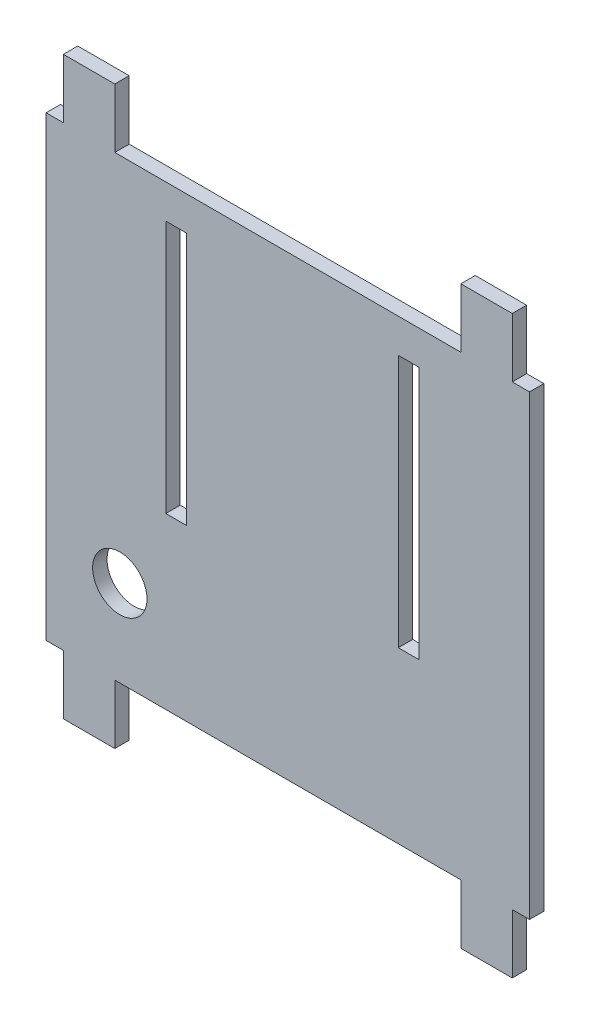
ISO-10303-21;
HEADER;
FILE_DESCRIPTION(('STEP AP214'),'2;1');
FILE_NAME('part.step','',(''),(''),'','','');
FILE_SCHEMA(('AUTOMOTIVE_DESIGN { 1 0 10303 214 1 1 1 1 }'));
ENDSEC;
DATA;
#1=APPLICATION_CONTEXT('core data for automotive mechanical design processes');
#2=APPLICATION_PROTOCOL_DEFINITION('international standard','automotive_design',2000,#1);
#3=PRODUCT_CONTEXT('',#1,'mechanical');
#4=PRODUCT('Part','Part','',(#3));
#5=PRODUCT_RELATED_PRODUCT_CATEGORY('part','',(#4));
#6=PRODUCT_DEFINITION_FORMATION('','',#4);
#7=PRODUCT_DEFINITION_CONTEXT('part definition',#1,'design');
#8=PRODUCT_DEFINITION('design','',#6,#7);
#9=PRODUCT_DEFINITION_SHAPE('','',#8);
#10=(LENGTH_UNIT() NAMED_UNIT(*) SI_UNIT(.MILLI.,.METRE.));
#11=(NAMED_UNIT(*) PLANE_ANGLE_UNIT() SI_UNIT($,.RADIAN.));
#12=(NAMED_UNIT(*) SI_UNIT($,.STERADIAN.) SOLID_ANGLE_UNIT());
#13=UNCERTAINTY_MEASURE_WITH_UNIT(LENGTH_MEASURE(1.E-05),#10,'distance_accuracy_value','');
#14=(GEOMETRIC_REPRESENTATION_CONTEXT(3) GLOBAL_UNCERTAINTY_ASSIGNED_CONTEXT((#13)) GLOBAL_UNIT_ASSIGNED_CONTEXT((#10,
#11,#12)) REPRESENTATION_CONTEXT('',''));
#15=CARTESIAN_POINT('',(0.,0.,0.));
#16=DIRECTION('',(0.,0.,1.));
#17=DIRECTION('',(1.,0.,0.));
#18=AXIS2_PLACEMENT_3D('',#15,#16,#17);
#19=CARTESIAN_POINT('',(-38.1782839349794,-47.5128276843631,3.175));
#20=DIRECTION('',(0.,1.,0.));
#21=DIRECTION('',(0.,0.,1.));
#22=AXIS2_PLACEMENT_3D('',#19,#20,#21);
#23=PLANE('',#22);
#24=DIRECTION('',(1.,0.,0.));
#25=VECTOR('',#24,1.);
#26=CARTESIAN_POINT('',(-38.1782839349794,-47.5128276843631,3.175));
#27=LINE('',#26,#25);
#28=CARTESIAN_POINT('',(-34.3682839349794,-47.5128276843631,3.175));
#29=VERTEX_POINT('',#28);
#30=CARTESIAN_POINT('',(-23.0182939349794,-47.5128276843631,3.175));
#31=VERTEX_POINT('',#30);
#32=EDGE_CURVE('E428',#29,#31,#27,.T.);
#33=ORIENTED_EDGE('',*,*,#32,.F.);
#34=DIRECTION('',(0.,0.,1.));
#35=VECTOR('',#34,1.);
#36=CARTESIAN_POINT('',(-34.3682839349794,-47.5128276843631,0.));
#37=LINE('',#36,#35);
#38=CARTESIAN_POINT('',(-34.3682839349794,-47.5128276843631,0.));
#39=VERTEX_POINT('',#38);
#40=EDGE_CURVE('E284',#39,#29,#37,.T.);
#41=ORIENTED_EDGE('',*,*,#40,.F.);
#42=DIRECTION('',(1.,0.,0.));
#43=VECTOR('',#42,1.);
#44=CARTESIAN_POINT('',(-38.1782839349794,-47.5128276843631,0.));
#45=LINE('',#44,#43);
#46=CARTESIAN_POINT('',(-23.0182939349794,-47.5128276843631,0.));
#47=VERTEX_POINT('',#46);
#48=EDGE_CURVE('E436',#39,#47,#45,.T.);
#49=ORIENTED_EDGE('',*,*,#48,.T.);
#50=DIRECTION('',(0.,0.,1.));
#51=VECTOR('',#50,1.);
#52=CARTESIAN_POINT('',(-23.0182939349794,-47.5128276843631,0.));
#53=LINE('',#52,#51);
#54=EDGE_CURVE('E305',#47,#31,#53,.T.);
#55=ORIENTED_EDGE('',*,*,#54,.T.);
#56=EDGE_LOOP('',(#33,#41,#49,#55));
#57=FACE_BOUND('',#56,.T.);
#58=ADVANCED_FACE('F34',(#57),#23,.F.);
#59=CARTESIAN_POINT('',(-38.1782839349794,79.4871723156369,3.175));
#60=DIRECTION('',(0.,-1.,0.));
#61=DIRECTION('',(0.,0.,-1.));
#62=AXIS2_PLACEMENT_3D('',#59,#60,#61);
#63=PLANE('',#62);
#64=DIRECTION('',(-1.,0.,0.));
#65=VECTOR('',#64,1.);
#66=CARTESIAN_POINT('',(-38.1782839349794,79.4871723156369,3.175));
#67=LINE('',#66,#65);
#68=CARTESIAN_POINT('',(-23.0182939349794,79.4871723156369,3.175));
#69=VERTEX_POINT('',#68);
#70=CARTESIAN_POINT('',(-34.3682839349794,79.4871723156369,3.175));
#71=VERTEX_POINT('',#70);
#72=EDGE_CURVE('E43',#69,#71,#67,.T.);
#73=ORIENTED_EDGE('',*,*,#72,.F.);
#74=DIRECTION('',(0.,0.,1.));
#75=VECTOR('',#74,1.);
#76=CARTESIAN_POINT('',(-23.0182939349794,79.4871723156369,0.));
#77=LINE('',#76,#75);
#78=CARTESIAN_POINT('',(-23.0182939349794,79.4871723156369,0.));
#79=VERTEX_POINT('',#78);
#80=EDGE_CURVE('E254',#79,#69,#77,.T.);
#81=ORIENTED_EDGE('',*,*,#80,.F.);
#82=DIRECTION('',(-1.,0.,0.));
#83=VECTOR('',#82,1.);
#84=CARTESIAN_POINT('',(-38.1782839349794,79.4871723156369,0.));
#85=LINE('',#84,#83);
#86=CARTESIAN_POINT('',(-34.3682839349794,79.4871723156369,0.));
#87=VERTEX_POINT('',#86);
#88=EDGE_CURVE('E38',#79,#87,#85,.T.);
#89=ORIENTED_EDGE('',*,*,#88,.T.);
#90=DIRECTION('',(0.,0.,1.));
#91=VECTOR('',#90,1.);
#92=CARTESIAN_POINT('',(-34.3682839349794,79.4871723156369,0.));
#93=LINE('',#92,#91);
#94=EDGE_CURVE('E350',#87,#71,#93,.T.);
#95=ORIENTED_EDGE('',*,*,#94,.T.);
#96=EDGE_LOOP('',(#73,#81,#89,#95));
#97=FACE_BOUND('',#96,.T.);
#98=ADVANCED_FACE('F478',(#97),#63,.F.);
#99=CARTESIAN_POINT('',(-38.1782839349794,79.4871723156369,3.175));
#100=DIRECTION('',(1.,0.,0.));
#101=DIRECTION('',(0.,1.,0.));
#102=AXIS2_PLACEMENT_3D('',#99,#100,#101);
#103=PLANE('',#102);
#104=DIRECTION('',(0.,-1.,0.));
#105=VECTOR('',#104,1.);
#106=CARTESIAN_POINT('',(-38.1782839349794,79.4871723156369,0.));
#107=LINE('',#106,#105);
#108=CARTESIAN_POINT('',(-38.1782839349794,66.4071629156369,0.));
#109=VERTEX_POINT('',#108);
#110=CARTESIAN_POINT('',(-38.1782839349794,-34.4328182843631,0.));
#111=VERTEX_POINT('',#110);
#112=EDGE_CURVE('E414',#109,#111,#107,.T.);
#113=ORIENTED_EDGE('',*,*,#112,.T.);
#114=DIRECTION('',(0.,0.,1.));
#115=VECTOR('',#114,1.);
#116=CARTESIAN_POINT('',(-38.1782839349794,-34.4328182843631,0.));
#117=LINE('',#116,#115);
#118=CARTESIAN_POINT('',(-38.1782839349794,-34.4328182843631,3.175));
#119=VERTEX_POINT('',#118);
#120=EDGE_CURVE('E270',#111,#119,#117,.T.);
#121=ORIENTED_EDGE('',*,*,#120,.T.);
#122=DIRECTION('',(0.,-1.,0.));
#123=VECTOR('',#122,1.);
#124=CARTESIAN_POINT('',(-38.1782839349794,79.4871723156369,3.175));
#125=LINE('',#124,#123);
#126=CARTESIAN_POINT('',(-38.1782839349794,66.4071629156369,3.175));
#127=VERTEX_POINT('',#126);
#128=EDGE_CURVE('E421',#127,#119,#125,.T.);
#129=ORIENTED_EDGE('',*,*,#128,.F.);
#130=DIRECTION('',(0.,0.,1.));
#131=VECTOR('',#130,1.);
#132=CARTESIAN_POINT('',(-38.1782839349794,66.4071629156369,0.));
#133=LINE('',#132,#131);
#134=EDGE_CURVE('E345',#109,#127,#133,.T.);
#135=ORIENTED_EDGE('',*,*,#134,.F.);
#136=EDGE_LOOP('',(#113,#121,#129,#135));
#137=FACE_BOUND('',#136,.T.);
#138=ADVANCED_FACE('F36',(#137),#103,.F.);
#139=CARTESIAN_POINT('',(53.3417260650209,-47.5128276843631,3.175));
#140=VERTEX_POINT('',#139);
#141=CARTESIAN_POINT('',(64.6917160650209,-47.5128276843631,3.175));
#142=VERTEX_POINT('',#141);
#143=EDGE_CURVE('E424',#140,#142,#27,.T.);
#144=ORIENTED_EDGE('',*,*,#143,.F.);
#145=DIRECTION('',(0.,0.,1.));
#146=VECTOR('',#145,1.);
#147=CARTESIAN_POINT('',(53.3417260650209,-47.5128276843631,0.));
#148=LINE('',#147,#146);
#149=CARTESIAN_POINT('',(53.3417260650209,-47.5128276843631,0.));
#150=VERTEX_POINT('',#149);
#151=EDGE_CURVE('E317',#150,#140,#148,.T.);
#152=ORIENTED_EDGE('',*,*,#151,.F.);
#153=CARTESIAN_POINT('',(64.6917160650209,-47.5128276843631,0.));
#154=VERTEX_POINT('',#153);
#155=EDGE_CURVE('E434',#150,#154,#45,.T.);
#156=ORIENTED_EDGE('',*,*,#155,.T.);
#157=DIRECTION('',(0.,0.,1.));
#158=VECTOR('',#157,1.);
#159=CARTESIAN_POINT('',(64.6917160650209,-47.5128276843631,0.));
#160=LINE('',#159,#158);
#161=EDGE_CURVE('E309',#154,#142,#160,.T.);
#162=ORIENTED_EDGE('',*,*,#161,.T.);
#163=EDGE_LOOP('',(#144,#152,#156,#162));
#164=FACE_BOUND('',#163,.T.);
#165=ADVANCED_FACE('F504',(#164),#23,.F.);
#166=CARTESIAN_POINT('',(68.5017160650206,79.4871723156369,3.175));
#167=DIRECTION('',(-1.,0.,0.));
#168=DIRECTION('',(0.,-1.,0.));
#169=AXIS2_PLACEMENT_3D('',#166,#167,#168);
#170=PLANE('',#169);
#171=DIRECTION('',(0.,1.,0.));
#172=VECTOR('',#171,1.);
#173=CARTESIAN_POINT('',(68.5017160650206,79.4871723156369,0.));
#174=LINE('',#173,#172);
#175=CARTESIAN_POINT('',(68.5017160650206,-34.4328182843631,0.));
#176=VERTEX_POINT('',#175);
#177=CARTESIAN_POINT('',(68.5017160650206,66.4071629156369,0.));
#178=VERTEX_POINT('',#177);
#179=EDGE_CURVE('E437',#176,#178,#174,.T.);
#180=ORIENTED_EDGE('',*,*,#179,.T.);
#181=DIRECTION('',(0.,0.,1.));
#182=VECTOR('',#181,1.);
#183=CARTESIAN_POINT('',(68.5017160650206,66.4071629156369,0.));
#184=LINE('',#183,#182);
#185=CARTESIAN_POINT('',(68.5017160650206,66.4071629156369,3.175));
#186=VERTEX_POINT('',#185);
#187=EDGE_CURVE('E252',#178,#186,#184,.T.);
#188=ORIENTED_EDGE('',*,*,#187,.T.);
#189=DIRECTION('',(0.,1.,0.));
#190=VECTOR('',#189,1.);
#191=CARTESIAN_POINT('',(68.5017160650206,79.4871723156369,3.175));
#192=LINE('',#191,#190);
#193=CARTESIAN_POINT('',(68.5017160650206,-34.4328182843631,3.175));
#194=VERTEX_POINT('',#193);
#195=EDGE_CURVE('E429',#194,#186,#192,.T.);
#196=ORIENTED_EDGE('',*,*,#195,.F.);
#197=DIRECTION('',(0.,0.,1.));
#198=VECTOR('',#197,1.);
#199=CARTESIAN_POINT('',(68.5017160650206,-34.4328182843631,0.));
#200=LINE('',#199,#198);
#201=EDGE_CURVE('E328',#176,#194,#200,.T.);
#202=ORIENTED_EDGE('',*,*,#201,.F.);
#203=EDGE_LOOP('',(#180,#188,#196,#202));
#204=FACE_BOUND('',#203,.T.);
#205=ADVANCED_FACE('F493',(#204),#170,.F.);
#206=CARTESIAN_POINT('',(64.6917160650206,79.4871723156369,0.));
#207=VERTEX_POINT('',#206);
#208=CARTESIAN_POINT('',(53.3417260650206,79.4871723156369,0.));
#209=VERTEX_POINT('',#208);
#210=EDGE_CURVE('E425',#207,#209,#85,.T.);
#211=ORIENTED_EDGE('',*,*,#210,.T.);
#212=DIRECTION('',(0.,0.,1.));
#213=VECTOR('',#212,1.);
#214=CARTESIAN_POINT('',(53.3417260650206,79.4871723156369,0.));
#215=LINE('',#214,#213);
#216=CARTESIAN_POINT('',(53.3417260650206,79.4871723156369,3.175));
#217=VERTEX_POINT('',#216);
#218=EDGE_CURVE('E257',#209,#217,#215,.T.);
#219=ORIENTED_EDGE('',*,*,#218,.T.);
#220=CARTESIAN_POINT('',(64.6917160650206,79.4871723156369,3.175));
#221=VERTEX_POINT('',#220);
#222=EDGE_CURVE('E12',#221,#217,#67,.T.);
#223=ORIENTED_EDGE('',*,*,#222,.F.);
#224=DIRECTION('',(0.,0.,1.));
#225=VECTOR('',#224,1.);
#226=CARTESIAN_POINT('',(64.6917160650206,79.4871723156369,0.));
#227=LINE('',#226,#225);
#228=EDGE_CURVE('E266',#207,#221,#227,.T.);
#229=ORIENTED_EDGE('',*,*,#228,.F.);
#230=EDGE_LOOP('',(#211,#219,#223,#229));
#231=FACE_BOUND('',#230,.T.);
#232=ADVANCED_FACE('F485',(#231),#63,.F.);
#233=CARTESIAN_POINT('',(0.,0.,3.175));
#234=DIRECTION('',(0.,0.,1.));
#235=DIRECTION('',(1.,0.,0.));
#236=AXIS2_PLACEMENT_3D('',#233,#234,#235);
#237=PLANE('',#236);
#238=CARTESIAN_POINT('',(-21.9095839349794,-15.3828182843631,3.175));
#239=DIRECTION('',(0.,0.,1.));
#240=DIRECTION('',(1.,0.,0.));
#241=AXIS2_PLACEMENT_3D('',#238,#239,#240);
#242=CIRCLE('',#241,5.999999938);
#243=CARTESIAN_POINT('',(-15.9095839969794,-15.3828182843631,3.175));
#244=VERTEX_POINT('',#243);
#245=EDGE_CURVE('E247',#244,#244,#242,.T.);
#246=ORIENTED_EDGE('',*,*,#245,.F.);
#247=EDGE_LOOP('',(#246));
#248=FACE_BOUND('',#247,.T.);
#249=DIRECTION('',(0.,-1.,0.));
#250=VECTOR('',#249,1.);
#251=CARTESIAN_POINT('',(-23.0182939349794,79.4871723156369,3.175));
#252=LINE('',#251,#250);
#253=CARTESIAN_POINT('',(-23.0182939349794,66.4071629156369,3.175));
#254=VERTEX_POINT('',#253);
#255=EDGE_CURVE('E227',#69,#254,#252,.T.);
#256=ORIENTED_EDGE('',*,*,#255,.F.);
#257=ORIENTED_EDGE('',*,*,#72,.T.);
#258=DIRECTION('',(0.,1.,0.));
#259=VECTOR('',#258,1.);
#260=CARTESIAN_POINT('',(-34.3682839349794,79.4871723156369,3.175));
#261=LINE('',#260,#259);
#262=CARTESIAN_POINT('',(-34.3682839349794,66.4071629156369,3.175));
#263=VERTEX_POINT('',#262);
#264=EDGE_CURVE('E343',#263,#71,#261,.T.);
#265=ORIENTED_EDGE('',*,*,#264,.F.);
#266=DIRECTION('',(1.,0.,0.));
#267=VECTOR('',#266,1.);
#268=CARTESIAN_POINT('',(-38.1782839349794,66.4071629156369,3.175));
#269=LINE('',#268,#267);
#270=EDGE_CURVE('E256',#127,#263,#269,.T.);
#271=ORIENTED_EDGE('',*,*,#270,.F.);
#272=ORIENTED_EDGE('',*,*,#128,.T.);
#273=DIRECTION('',(-1.,0.,0.));
#274=VECTOR('',#273,1.);
#275=CARTESIAN_POINT('',(-38.1782839349794,-34.4328182843631,3.175));
#276=LINE('',#275,#274);
#277=CARTESIAN_POINT('',(-34.3682839349794,-34.4328182843631,3.175));
#278=VERTEX_POINT('',#277);
#279=EDGE_CURVE('E281',#278,#119,#276,.T.);
#280=ORIENTED_EDGE('',*,*,#279,.F.);
#281=DIRECTION('',(0.,1.,0.));
#282=VECTOR('',#281,1.);
#283=CARTESIAN_POINT('',(-34.3682839349794,-34.4328182843631,3.175));
#284=LINE('',#283,#282);
#285=EDGE_CURVE('E285',#29,#278,#284,.T.);
#286=ORIENTED_EDGE('',*,*,#285,.F.);
#287=ORIENTED_EDGE('',*,*,#32,.T.);
#288=DIRECTION('',(0.,-1.,0.));
#289=VECTOR('',#288,1.);
#290=CARTESIAN_POINT('',(-23.0182939349794,-34.4328182843631,3.175));
#291=LINE('',#290,#289);
#292=CARTESIAN_POINT('',(-23.0182939349794,-34.4328182843631,3.175));
#293=VERTEX_POINT('',#292);
#294=EDGE_CURVE('E306',#293,#31,#291,.T.);
#295=ORIENTED_EDGE('',*,*,#294,.F.);
#296=DIRECTION('',(-1.,0.,0.));
#297=VECTOR('',#296,1.);
#298=CARTESIAN_POINT('',(-23.0182939349794,-34.4328182843631,3.175));
#299=LINE('',#298,#297);
#300=CARTESIAN_POINT('',(53.3417260650209,-34.4328182843631,3.175));
#301=VERTEX_POINT('',#300);
#302=EDGE_CURVE('E299',#301,#293,#299,.T.);
#303=ORIENTED_EDGE('',*,*,#302,.F.);
#304=DIRECTION('',(0.,1.,0.));
#305=VECTOR('',#304,1.);
#306=CARTESIAN_POINT('',(53.3417260650209,-34.4328182843631,3.175));
#307=LINE('',#306,#305);
#308=EDGE_CURVE('E308',#140,#301,#307,.T.);
#309=ORIENTED_EDGE('',*,*,#308,.F.);
#310=ORIENTED_EDGE('',*,*,#143,.T.);
#311=DIRECTION('',(0.,-1.,0.));
#312=VECTOR('',#311,1.);
#313=CARTESIAN_POINT('',(64.6917160650209,-34.4328182843631,3.175));
#314=LINE('',#313,#312);
#315=CARTESIAN_POINT('',(64.6917160650209,-34.4328182843631,3.175));
#316=VERTEX_POINT('',#315);
#317=EDGE_CURVE('E325',#316,#142,#314,.T.);
#318=ORIENTED_EDGE('',*,*,#317,.F.);
#319=DIRECTION('',(-1.,0.,0.));
#320=VECTOR('',#319,1.);
#321=CARTESIAN_POINT('',(68.5017160650206,-34.4328182843631,3.175));
#322=LINE('',#321,#320);
#323=EDGE_CURVE('E329',#194,#316,#322,.T.);
#324=ORIENTED_EDGE('',*,*,#323,.F.);
#325=ORIENTED_EDGE('',*,*,#195,.T.);
#326=DIRECTION('',(1.,0.,0.));
#327=VECTOR('',#326,1.);
#328=CARTESIAN_POINT('',(68.5017160650206,66.4071629156369,3.175));
#329=LINE('',#328,#327);
#330=CARTESIAN_POINT('',(64.6917160650206,66.4071629156369,3.175));
#331=VERTEX_POINT('',#330);
#332=EDGE_CURVE('E264',#331,#186,#329,.T.);
#333=ORIENTED_EDGE('',*,*,#332,.F.);
#334=DIRECTION('',(0.,-1.,0.));
#335=VECTOR('',#334,1.);
#336=CARTESIAN_POINT('',(64.6917160650206,79.4871723156369,3.175));
#337=LINE('',#336,#335);
#338=EDGE_CURVE('E267',#221,#331,#337,.T.);
#339=ORIENTED_EDGE('',*,*,#338,.F.);
#340=ORIENTED_EDGE('',*,*,#222,.T.);
#341=DIRECTION('',(0.,1.,0.));
#342=VECTOR('',#341,1.);
#343=CARTESIAN_POINT('',(53.3417260650206,79.4871723156369,3.175));
#344=LINE('',#343,#342);
#345=CARTESIAN_POINT('',(53.3417260650206,66.4071629156369,3.175));
#346=VERTEX_POINT('',#345);
#347=EDGE_CURVE('E242',#346,#217,#344,.T.);
#348=ORIENTED_EDGE('',*,*,#347,.F.);
#349=DIRECTION('',(1.,0.,0.));
#350=VECTOR('',#349,1.);
#351=CARTESIAN_POINT('',(-23.0182939349794,66.4071629156369,3.175));
#352=LINE('',#351,#350);
#353=EDGE_CURVE('E244',#254,#346,#352,.T.);
#354=ORIENTED_EDGE('',*,*,#353,.F.);
#355=EDGE_LOOP('',(#256,#257,#265,#271,#272,#280,#286,#287,#295,#303,#309,#310,#318,#324,#325,
#333,#339,#340,#348,#354));
#356=FACE_BOUND('',#355,.T.);
#357=DIRECTION('',(0.,-1.,0.));
#358=VECTOR('',#357,1.);
#359=CARTESIAN_POINT('',(39.5457160650206,58.9131723156369,3.175));
#360=LINE('',#359,#358);
#361=CARTESIAN_POINT('',(39.5457160650206,58.9131723156369,3.175));
#362=VERTEX_POINT('',#361);
#363=CARTESIAN_POINT('',(39.5457160650206,3.0331723156369,3.175));
#364=VERTEX_POINT('',#363);
#365=EDGE_CURVE('E353',#362,#364,#360,.T.);
#366=ORIENTED_EDGE('',*,*,#365,.F.);
#367=DIRECTION('',(-1.,0.,0.));
#368=VECTOR('',#367,1.);
#369=CARTESIAN_POINT('',(39.5457160650206,58.9131723156369,3.175));
#370=LINE('',#369,#368);
#371=CARTESIAN_POINT('',(44.1177160650206,58.9131723156369,3.175));
#372=VERTEX_POINT('',#371);
#373=EDGE_CURVE('E361',#372,#362,#370,.T.);
#374=ORIENTED_EDGE('',*,*,#373,.F.);
#375=DIRECTION('',(0.,1.,0.));
#376=VECTOR('',#375,1.);
#377=CARTESIAN_POINT('',(44.1177160650206,58.9131723156369,3.175));
#378=LINE('',#377,#376);
#379=CARTESIAN_POINT('',(44.1177160650206,3.03317231563689,3.175));
#380=VERTEX_POINT('',#379);
#381=EDGE_CURVE('E375',#380,#372,#378,.T.);
#382=ORIENTED_EDGE('',*,*,#381,.F.);
#383=DIRECTION('',(1.,0.,0.));
#384=VECTOR('',#383,1.);
#385=CARTESIAN_POINT('',(39.5457160650206,3.0331723156369,3.175));
#386=LINE('',#385,#384);
#387=EDGE_CURVE('E372',#364,#380,#386,.T.);
#388=ORIENTED_EDGE('',*,*,#387,.F.);
#389=EDGE_LOOP('',(#366,#374,#382,#388));
#390=FACE_BOUND('',#389,.T.);
#391=DIRECTION('',(0.,-1.,0.));
#392=VECTOR('',#391,1.);
#393=CARTESIAN_POINT('',(-11.7622839349794,58.9131723156369,3.175));
#394=LINE('',#393,#392);
#395=CARTESIAN_POINT('',(-11.7622839349794,58.9131723156369,3.175));
#396=VERTEX_POINT('',#395);
#397=CARTESIAN_POINT('',(-11.7622839349794,3.03317231563691,3.175));
#398=VERTEX_POINT('',#397);
#399=EDGE_CURVE('E382',#396,#398,#394,.T.);
#400=ORIENTED_EDGE('',*,*,#399,.F.);
#401=DIRECTION('',(-1.,0.,0.));
#402=VECTOR('',#401,1.);
#403=CARTESIAN_POINT('',(-11.7622839349794,58.9131723156369,3.175));
#404=LINE('',#403,#402);
#405=CARTESIAN_POINT('',(-7.19028393497942,58.9131723156369,3.175));
#406=VERTEX_POINT('',#405);
#407=EDGE_CURVE('E393',#406,#396,#404,.T.);
#408=ORIENTED_EDGE('',*,*,#407,.F.);
#409=DIRECTION('',(0.,1.,0.));
#410=VECTOR('',#409,1.);
#411=CARTESIAN_POINT('',(-7.19028393497942,58.9131723156369,3.175));
#412=LINE('',#411,#410);
#413=CARTESIAN_POINT('',(-7.19028393497942,3.0331723156369,3.175));
#414=VERTEX_POINT('',#413);
#415=EDGE_CURVE('E407',#414,#406,#412,.T.);
#416=ORIENTED_EDGE('',*,*,#415,.F.);
#417=DIRECTION('',(1.,0.,0.));
#418=VECTOR('',#417,1.);
#419=CARTESIAN_POINT('',(-11.7622839349794,3.03317231563691,3.175));
#420=LINE('',#419,#418);
#421=EDGE_CURVE('E404',#398,#414,#420,.T.);
#422=ORIENTED_EDGE('',*,*,#421,.F.);
#423=EDGE_LOOP('',(#400,#408,#416,#422));
#424=FACE_BOUND('',#423,.T.);
#425=ADVANCED_FACE('F454',(#248,#356,#390,#424),#237,.T.);
#426=CARTESIAN_POINT('',(0.,0.,0.));
#427=DIRECTION('',(0.,0.,1.));
#428=DIRECTION('',(1.,0.,0.));
#429=AXIS2_PLACEMENT_3D('',#426,#427,#428);
#430=PLANE('',#429);
#431=CARTESIAN_POINT('',(-21.9095839349794,-15.3828182843631,0.));
#432=DIRECTION('',(0.,0.,1.));
#433=DIRECTION('',(1.,0.,0.));
#434=AXIS2_PLACEMENT_3D('',#431,#432,#433);
#435=CIRCLE('',#434,5.999999938);
#436=CARTESIAN_POINT('',(-15.9095839969794,-15.3828182843631,0.));
#437=VERTEX_POINT('',#436);
#438=EDGE_CURVE('E332',#437,#437,#435,.T.);
#439=ORIENTED_EDGE('',*,*,#438,.T.);
#440=EDGE_LOOP('',(#439));
#441=FACE_BOUND('',#440,.T.);
#442=ORIENTED_EDGE('',*,*,#88,.F.);
#443=DIRECTION('',(0.,-1.,0.));
#444=VECTOR('',#443,1.);
#445=CARTESIAN_POINT('',(-23.0182939349794,79.4871723156369,0.));
#446=LINE('',#445,#444);
#447=CARTESIAN_POINT('',(-23.0182939349794,66.4071629156369,0.));
#448=VERTEX_POINT('',#447);
#449=EDGE_CURVE('E224',#79,#448,#446,.T.);
#450=ORIENTED_EDGE('',*,*,#449,.T.);
#451=DIRECTION('',(1.,0.,0.));
#452=VECTOR('',#451,1.);
#453=CARTESIAN_POINT('',(-23.0182939349794,66.4071629156369,0.));
#454=LINE('',#453,#452);
#455=CARTESIAN_POINT('',(53.3417260650206,66.4071629156369,0.));
#456=VERTEX_POINT('',#455);
#457=EDGE_CURVE('E234',#448,#456,#454,.T.);
#458=ORIENTED_EDGE('',*,*,#457,.T.);
#459=DIRECTION('',(0.,1.,0.));
#460=VECTOR('',#459,1.);
#461=CARTESIAN_POINT('',(53.3417260650206,79.4871723156369,0.));
#462=LINE('',#461,#460);
#463=EDGE_CURVE('E51',#456,#209,#462,.T.);
#464=ORIENTED_EDGE('',*,*,#463,.T.);
#465=ORIENTED_EDGE('',*,*,#210,.F.);
#466=DIRECTION('',(0.,-1.,0.));
#467=VECTOR('',#466,1.);
#468=CARTESIAN_POINT('',(64.6917160650206,79.4871723156369,0.));
#469=LINE('',#468,#467);
#470=CARTESIAN_POINT('',(64.6917160650206,66.4071629156369,0.));
#471=VERTEX_POINT('',#470);
#472=EDGE_CURVE('E261',#207,#471,#469,.T.);
#473=ORIENTED_EDGE('',*,*,#472,.T.);
#474=DIRECTION('',(1.,0.,0.));
#475=VECTOR('',#474,1.);
#476=CARTESIAN_POINT('',(68.5017160650206,66.4071629156369,0.));
#477=LINE('',#476,#475);
#478=EDGE_CURVE('E59',#471,#178,#477,.T.);
#479=ORIENTED_EDGE('',*,*,#478,.T.);
#480=ORIENTED_EDGE('',*,*,#179,.F.);
#481=DIRECTION('',(-1.,0.,0.));
#482=VECTOR('',#481,1.);
#483=CARTESIAN_POINT('',(68.5017160650206,-34.4328182843631,0.));
#484=LINE('',#483,#482);
#485=CARTESIAN_POINT('',(64.6917160650209,-34.4328182843631,0.));
#486=VERTEX_POINT('',#485);
#487=EDGE_CURVE('E321',#176,#486,#484,.T.);
#488=ORIENTED_EDGE('',*,*,#487,.T.);
#489=DIRECTION('',(0.,-1.,0.));
#490=VECTOR('',#489,1.);
#491=CARTESIAN_POINT('',(64.6917160650209,-34.4328182843631,0.));
#492=LINE('',#491,#490);
#493=EDGE_CURVE('E324',#486,#154,#492,.T.);
#494=ORIENTED_EDGE('',*,*,#493,.T.);
#495=ORIENTED_EDGE('',*,*,#155,.F.);
#496=DIRECTION('',(0.,1.,0.));
#497=VECTOR('',#496,1.);
#498=CARTESIAN_POINT('',(53.3417260650209,-34.4328182843631,0.));
#499=LINE('',#498,#497);
#500=CARTESIAN_POINT('',(53.3417260650209,-34.4328182843631,0.));
#501=VERTEX_POINT('',#500);
#502=EDGE_CURVE('E298',#150,#501,#499,.T.);
#503=ORIENTED_EDGE('',*,*,#502,.T.);
#504=DIRECTION('',(-1.,0.,0.));
#505=VECTOR('',#504,1.);
#506=CARTESIAN_POINT('',(-23.0182939349794,-34.4328182843631,0.));
#507=LINE('',#506,#505);
#508=CARTESIAN_POINT('',(-23.0182939349794,-34.4328182843631,0.));
#509=VERTEX_POINT('',#508);
#510=EDGE_CURVE('E302',#501,#509,#507,.T.);
#511=ORIENTED_EDGE('',*,*,#510,.T.);
#512=DIRECTION('',(0.,-1.,0.));
#513=VECTOR('',#512,1.);
#514=CARTESIAN_POINT('',(-23.0182939349794,-34.4328182843631,0.));
#515=LINE('',#514,#513);
#516=EDGE_CURVE('E295',#509,#47,#515,.T.);
#517=ORIENTED_EDGE('',*,*,#516,.T.);
#518=ORIENTED_EDGE('',*,*,#48,.F.);
#519=DIRECTION('',(0.,1.,0.));
#520=VECTOR('',#519,1.);
#521=CARTESIAN_POINT('',(-34.3682839349794,-34.4328182843631,0.));
#522=LINE('',#521,#520);
#523=CARTESIAN_POINT('',(-34.3682839349794,-34.4328182843631,0.));
#524=VERTEX_POINT('',#523);
#525=EDGE_CURVE('E277',#39,#524,#522,.T.);
#526=ORIENTED_EDGE('',*,*,#525,.T.);
#527=DIRECTION('',(-1.,0.,0.));
#528=VECTOR('',#527,1.);
#529=CARTESIAN_POINT('',(-38.1782839349794,-34.4328182843631,0.));
#530=LINE('',#529,#528);
#531=EDGE_CURVE('E280',#524,#111,#530,.T.);
#532=ORIENTED_EDGE('',*,*,#531,.T.);
#533=ORIENTED_EDGE('',*,*,#112,.F.);
#534=DIRECTION('',(1.,0.,0.));
#535=VECTOR('',#534,1.);
#536=CARTESIAN_POINT('',(-38.1782839349794,66.4071629156369,0.));
#537=LINE('',#536,#535);
#538=CARTESIAN_POINT('',(-34.3682839349794,66.4071629156369,0.));
#539=VERTEX_POINT('',#538);
#540=EDGE_CURVE('E339',#109,#539,#537,.T.);
#541=ORIENTED_EDGE('',*,*,#540,.T.);
#542=DIRECTION('',(0.,1.,0.));
#543=VECTOR('',#542,1.);
#544=CARTESIAN_POINT('',(-34.3682839349794,79.4871723156369,0.));
#545=LINE('',#544,#543);
#546=EDGE_CURVE('E342',#539,#87,#545,.T.);
#547=ORIENTED_EDGE('',*,*,#546,.T.);
#548=EDGE_LOOP('',(#442,#450,#458,#464,#465,#473,#479,#480,#488,#494,#495,#503,#511,#517,#518,
#526,#532,#533,#541,#547));
#549=FACE_BOUND('',#548,.T.);
#550=DIRECTION('',(-1.,0.,0.));
#551=VECTOR('',#550,1.);
#552=CARTESIAN_POINT('',(39.5457160650206,58.9131723156369,0.));
#553=LINE('',#552,#551);
#554=CARTESIAN_POINT('',(44.1177160650206,58.9131723156369,0.));
#555=VERTEX_POINT('',#554);
#556=CARTESIAN_POINT('',(39.5457160650206,58.9131723156369,0.));
#557=VERTEX_POINT('',#556);
#558=EDGE_CURVE('E367',#555,#557,#553,.T.);
#559=ORIENTED_EDGE('',*,*,#558,.T.);
#560=DIRECTION('',(0.,-1.,0.));
#561=VECTOR('',#560,1.);
#562=CARTESIAN_POINT('',(39.5457160650206,58.9131723156369,0.));
#563=LINE('',#562,#561);
#564=CARTESIAN_POINT('',(39.5457160650206,3.0331723156369,0.));
#565=VERTEX_POINT('',#564);
#566=EDGE_CURVE('E357',#557,#565,#563,.T.);
#567=ORIENTED_EDGE('',*,*,#566,.T.);
#568=DIRECTION('',(1.,0.,0.));
#569=VECTOR('',#568,1.);
#570=CARTESIAN_POINT('',(39.5457160650206,3.0331723156369,0.));
#571=LINE('',#570,#569);
#572=CARTESIAN_POINT('',(44.1177160650206,3.03317231563689,0.));
#573=VERTEX_POINT('',#572);
#574=EDGE_CURVE('E360',#565,#573,#571,.T.);
#575=ORIENTED_EDGE('',*,*,#574,.T.);
#576=DIRECTION('',(0.,1.,0.));
#577=VECTOR('',#576,1.);
#578=CARTESIAN_POINT('',(44.1177160650206,58.9131723156369,0.));
#579=LINE('',#578,#577);
#580=EDGE_CURVE('E364',#573,#555,#579,.T.);
#581=ORIENTED_EDGE('',*,*,#580,.T.);
#582=EDGE_LOOP('',(#559,#567,#575,#581));
#583=FACE_BOUND('',#582,.T.);
#584=DIRECTION('',(-1.,0.,0.));
#585=VECTOR('',#584,1.);
#586=CARTESIAN_POINT('',(-11.7622839349794,58.9131723156369,0.));
#587=LINE('',#586,#585);
#588=CARTESIAN_POINT('',(-7.19028393497942,58.9131723156369,0.));
#589=VERTEX_POINT('',#588);
#590=CARTESIAN_POINT('',(-11.7622839349794,58.9131723156369,0.));
#591=VERTEX_POINT('',#590);
#592=EDGE_CURVE('E399',#589,#591,#587,.T.);
#593=ORIENTED_EDGE('',*,*,#592,.T.);
#594=DIRECTION('',(0.,-1.,0.));
#595=VECTOR('',#594,1.);
#596=CARTESIAN_POINT('',(-11.7622839349794,58.9131723156369,0.));
#597=LINE('',#596,#595);
#598=CARTESIAN_POINT('',(-11.7622839349794,3.03317231563691,0.));
#599=VERTEX_POINT('',#598);
#600=EDGE_CURVE('E389',#591,#599,#597,.T.);
#601=ORIENTED_EDGE('',*,*,#600,.T.);
#602=DIRECTION('',(1.,0.,0.));
#603=VECTOR('',#602,1.);
#604=CARTESIAN_POINT('',(-11.7622839349794,3.03317231563691,0.));
#605=LINE('',#604,#603);
#606=CARTESIAN_POINT('',(-7.19028393497942,3.0331723156369,0.));
#607=VERTEX_POINT('',#606);
#608=EDGE_CURVE('E392',#599,#607,#605,.T.);
#609=ORIENTED_EDGE('',*,*,#608,.T.);
#610=DIRECTION('',(0.,1.,0.));
#611=VECTOR('',#610,1.);
#612=CARTESIAN_POINT('',(-7.19028393497942,58.9131723156369,0.));
#613=LINE('',#612,#611);
#614=EDGE_CURVE('E396',#607,#589,#613,.T.);
#615=ORIENTED_EDGE('',*,*,#614,.T.);
#616=EDGE_LOOP('',(#593,#601,#609,#615));
#617=FACE_BOUND('',#616,.T.);
#618=ADVANCED_FACE('F239',(#441,#549,#583,#617),#430,.F.);
#619=CARTESIAN_POINT('',(-11.7622839349794,58.9131723156369,0.));
#620=DIRECTION('',(-1.,0.,0.));
#621=DIRECTION('',(0.,0.,1.));
#622=AXIS2_PLACEMENT_3D('',#619,#620,#621);
#623=PLANE('',#622);
#624=ORIENTED_EDGE('',*,*,#399,.T.);
#625=DIRECTION('',(0.,0.,1.));
#626=VECTOR('',#625,1.);
#627=CARTESIAN_POINT('',(-11.7622839349794,3.03317231563691,0.));
#628=LINE('',#627,#626);
#629=EDGE_CURVE('E402',#599,#398,#628,.T.);
#630=ORIENTED_EDGE('',*,*,#629,.F.);
#631=ORIENTED_EDGE('',*,*,#600,.F.);
#632=DIRECTION('',(0.,0.,1.));
#633=VECTOR('',#632,1.);
#634=CARTESIAN_POINT('',(-11.7622839349794,58.9131723156369,0.));
#635=LINE('',#634,#633);
#636=EDGE_CURVE('E412',#591,#396,#635,.T.);
#637=ORIENTED_EDGE('',*,*,#636,.T.);
#638=EDGE_LOOP('',(#624,#630,#631,#637));
#639=FACE_BOUND('',#638,.T.);
#640=ADVANCED_FACE('F612',(#639),#623,.F.);
#641=CARTESIAN_POINT('',(-11.7622839349794,58.9131723156369,0.));
#642=DIRECTION('',(0.,1.,0.));
#643=DIRECTION('',(-1.,0.,0.));
#644=AXIS2_PLACEMENT_3D('',#641,#642,#643);
#645=PLANE('',#644);
#646=ORIENTED_EDGE('',*,*,#407,.T.);
#647=ORIENTED_EDGE('',*,*,#636,.F.);
#648=ORIENTED_EDGE('',*,*,#592,.F.);
#649=DIRECTION('',(0.,0.,1.));
#650=VECTOR('',#649,1.);
#651=CARTESIAN_POINT('',(-7.19028393497942,58.9131723156369,0.));
#652=LINE('',#651,#650);
#653=EDGE_CURVE('E415',#589,#406,#652,.T.);
#654=ORIENTED_EDGE('',*,*,#653,.T.);
#655=EDGE_LOOP('',(#646,#647,#648,#654));
#656=FACE_BOUND('',#655,.T.);
#657=ADVANCED_FACE('F602',(#656),#645,.F.);
#658=CARTESIAN_POINT('',(-7.19028393497942,58.9131723156369,0.));
#659=DIRECTION('',(1.,0.,0.));
#660=DIRECTION('',(0.,0.,-1.));
#661=AXIS2_PLACEMENT_3D('',#658,#659,#660);
#662=PLANE('',#661);
#663=ORIENTED_EDGE('',*,*,#415,.T.);
#664=ORIENTED_EDGE('',*,*,#653,.F.);
#665=ORIENTED_EDGE('',*,*,#614,.F.);
#666=DIRECTION('',(0.,0.,1.));
#667=VECTOR('',#666,1.);
#668=CARTESIAN_POINT('',(-7.19028393497942,3.0331723156369,0.));
#669=LINE('',#668,#667);
#670=EDGE_CURVE('E417',#607,#414,#669,.T.);
#671=ORIENTED_EDGE('',*,*,#670,.T.);
#672=EDGE_LOOP('',(#663,#664,#665,#671));
#673=FACE_BOUND('',#672,.T.);
#674=ADVANCED_FACE('F592',(#673),#662,.F.);
#675=CARTESIAN_POINT('',(-11.7622839349794,3.03317231563691,0.));
#676=DIRECTION('',(0.,-1.,0.));
#677=DIRECTION('',(1.,0.,0.));
#678=AXIS2_PLACEMENT_3D('',#675,#676,#677);
#679=PLANE('',#678);
#680=ORIENTED_EDGE('',*,*,#421,.T.);
#681=ORIENTED_EDGE('',*,*,#670,.F.);
#682=ORIENTED_EDGE('',*,*,#608,.F.);
#683=ORIENTED_EDGE('',*,*,#629,.T.);
#684=EDGE_LOOP('',(#680,#681,#682,#683));
#685=FACE_BOUND('',#684,.T.);
#686=ADVANCED_FACE('F582',(#685),#679,.F.);
#687=CARTESIAN_POINT('',(39.5457160650206,58.9131723156369,0.));
#688=DIRECTION('',(-1.,0.,0.));
#689=DIRECTION('',(0.,0.,1.));
#690=AXIS2_PLACEMENT_3D('',#687,#688,#689);
#691=PLANE('',#690);
#692=ORIENTED_EDGE('',*,*,#365,.T.);
#693=DIRECTION('',(0.,0.,1.));
#694=VECTOR('',#693,1.);
#695=CARTESIAN_POINT('',(39.5457160650206,3.0331723156369,0.));
#696=LINE('',#695,#694);
#697=EDGE_CURVE('E370',#565,#364,#696,.T.);
#698=ORIENTED_EDGE('',*,*,#697,.F.);
#699=ORIENTED_EDGE('',*,*,#566,.F.);
#700=DIRECTION('',(0.,0.,1.));
#701=VECTOR('',#700,1.);
#702=CARTESIAN_POINT('',(39.5457160650206,58.9131723156369,0.));
#703=LINE('',#702,#701);
#704=EDGE_CURVE('E380',#557,#362,#703,.T.);
#705=ORIENTED_EDGE('',*,*,#704,.T.);
#706=EDGE_LOOP('',(#692,#698,#699,#705));
#707=FACE_BOUND('',#706,.T.);
#708=ADVANCED_FACE('F572',(#707),#691,.F.);
#709=CARTESIAN_POINT('',(39.5457160650206,58.9131723156369,0.));
#710=DIRECTION('',(0.,1.,0.));
#711=DIRECTION('',(-1.,0.,0.));
#712=AXIS2_PLACEMENT_3D('',#709,#710,#711);
#713=PLANE('',#712);
#714=ORIENTED_EDGE('',*,*,#373,.T.);
#715=ORIENTED_EDGE('',*,*,#704,.F.);
#716=ORIENTED_EDGE('',*,*,#558,.F.);
#717=DIRECTION('',(0.,0.,1.));
#718=VECTOR('',#717,1.);
#719=CARTESIAN_POINT('',(44.1177160650206,58.9131723156369,0.));
#720=LINE('',#719,#718);
#721=EDGE_CURVE('E383',#555,#372,#720,.T.);
#722=ORIENTED_EDGE('',*,*,#721,.T.);
#723=EDGE_LOOP('',(#714,#715,#716,#722));
#724=FACE_BOUND('',#723,.T.);
#725=ADVANCED_FACE('F562',(#724),#713,.F.);
#726=CARTESIAN_POINT('',(44.1177160650206,58.9131723156369,0.));
#727=DIRECTION('',(1.,0.,0.));
#728=DIRECTION('',(0.,0.,-1.));
#729=AXIS2_PLACEMENT_3D('',#726,#727,#728);
#730=PLANE('',#729);
#731=ORIENTED_EDGE('',*,*,#381,.T.);
#732=ORIENTED_EDGE('',*,*,#721,.F.);
#733=ORIENTED_EDGE('',*,*,#580,.F.);
#734=DIRECTION('',(0.,0.,1.));
#735=VECTOR('',#734,1.);
#736=CARTESIAN_POINT('',(44.1177160650206,3.03317231563689,0.));
#737=LINE('',#736,#735);
#738=EDGE_CURVE('E385',#573,#380,#737,.T.);
#739=ORIENTED_EDGE('',*,*,#738,.T.);
#740=EDGE_LOOP('',(#731,#732,#733,#739));
#741=FACE_BOUND('',#740,.T.);
#742=ADVANCED_FACE('F551',(#741),#730,.F.);
#743=CARTESIAN_POINT('',(39.5457160650206,3.0331723156369,0.));
#744=DIRECTION('',(0.,-1.,0.));
#745=DIRECTION('',(1.,0.,0.));
#746=AXIS2_PLACEMENT_3D('',#743,#744,#745);
#747=PLANE('',#746);
#748=ORIENTED_EDGE('',*,*,#387,.T.);
#749=ORIENTED_EDGE('',*,*,#738,.F.);
#750=ORIENTED_EDGE('',*,*,#574,.F.);
#751=ORIENTED_EDGE('',*,*,#697,.T.);
#752=EDGE_LOOP('',(#748,#749,#750,#751));
#753=FACE_BOUND('',#752,.T.);
#754=ADVANCED_FACE('F547',(#753),#747,.F.);
#755=CARTESIAN_POINT('',(-34.3682839349794,79.4871723156369,0.));
#756=DIRECTION('',(1.,0.,0.));
#757=DIRECTION('',(0.,0.,-1.));
#758=AXIS2_PLACEMENT_3D('',#755,#756,#757);
#759=PLANE('',#758);
#760=ORIENTED_EDGE('',*,*,#264,.T.);
#761=ORIENTED_EDGE('',*,*,#94,.F.);
#762=ORIENTED_EDGE('',*,*,#546,.F.);
#763=DIRECTION('',(0.,0.,1.));
#764=VECTOR('',#763,1.);
#765=CARTESIAN_POINT('',(-34.3682839349794,66.4071629156369,0.));
#766=LINE('',#765,#764);
#767=EDGE_CURVE('E354',#539,#263,#766,.T.);
#768=ORIENTED_EDGE('',*,*,#767,.T.);
#769=EDGE_LOOP('',(#760,#761,#762,#768));
#770=FACE_BOUND('',#769,.T.);
#771=ADVANCED_FACE('F476',(#770),#759,.F.);
#772=CARTESIAN_POINT('',(-38.1782839349794,66.4071629156369,0.));
#773=DIRECTION('',(0.,-1.,0.));
#774=DIRECTION('',(0.,0.,-1.));
#775=AXIS2_PLACEMENT_3D('',#772,#773,#774);
#776=PLANE('',#775);
#777=ORIENTED_EDGE('',*,*,#270,.T.);
#778=ORIENTED_EDGE('',*,*,#767,.F.);
#779=ORIENTED_EDGE('',*,*,#540,.F.);
#780=ORIENTED_EDGE('',*,*,#134,.T.);
#781=EDGE_LOOP('',(#777,#778,#779,#780));
#782=FACE_BOUND('',#781,.T.);
#783=ADVANCED_FACE('F470',(#782),#776,.F.);
#784=CARTESIAN_POINT('',(64.6917160650209,-34.4328182843631,0.));
#785=DIRECTION('',(-1.,0.,0.));
#786=DIRECTION('',(0.,0.,1.));
#787=AXIS2_PLACEMENT_3D('',#784,#785,#786);
#788=PLANE('',#787);
#789=ORIENTED_EDGE('',*,*,#317,.T.);
#790=ORIENTED_EDGE('',*,*,#161,.F.);
#791=ORIENTED_EDGE('',*,*,#493,.F.);
#792=DIRECTION('',(0.,0.,1.));
#793=VECTOR('',#792,1.);
#794=CARTESIAN_POINT('',(64.6917160650209,-34.4328182843631,0.));
#795=LINE('',#794,#793);
#796=EDGE_CURVE('E336',#486,#316,#795,.T.);
#797=ORIENTED_EDGE('',*,*,#796,.T.);
#798=EDGE_LOOP('',(#789,#790,#791,#797));
#799=FACE_BOUND('',#798,.T.);
#800=ADVANCED_FACE('F676',(#799),#788,.F.);
#801=CARTESIAN_POINT('',(68.5017160650206,-34.4328182843631,0.));
#802=DIRECTION('',(0.,1.,0.));
#803=DIRECTION('',(0.,0.,1.));
#804=AXIS2_PLACEMENT_3D('',#801,#802,#803);
#805=PLANE('',#804);
#806=ORIENTED_EDGE('',*,*,#323,.T.);
#807=ORIENTED_EDGE('',*,*,#796,.F.);
#808=ORIENTED_EDGE('',*,*,#487,.F.);
#809=ORIENTED_EDGE('',*,*,#201,.T.);
#810=EDGE_LOOP('',(#806,#807,#808,#809));
#811=FACE_BOUND('',#810,.T.);
#812=ADVANCED_FACE('F498',(#811),#805,.F.);
#813=CARTESIAN_POINT('',(-23.0182939349794,-34.4328182843631,0.));
#814=DIRECTION('',(-1.,0.,0.));
#815=DIRECTION('',(0.,0.,1.));
#816=AXIS2_PLACEMENT_3D('',#813,#814,#815);
#817=PLANE('',#816);
#818=ORIENTED_EDGE('',*,*,#294,.T.);
#819=ORIENTED_EDGE('',*,*,#54,.F.);
#820=ORIENTED_EDGE('',*,*,#516,.F.);
#821=DIRECTION('',(0.,0.,1.));
#822=VECTOR('',#821,1.);
#823=CARTESIAN_POINT('',(-23.0182939349794,-34.4328182843631,0.));
#824=LINE('',#823,#822);
#825=EDGE_CURVE('E288',#509,#293,#824,.T.);
#826=ORIENTED_EDGE('',*,*,#825,.T.);
#827=EDGE_LOOP('',(#818,#819,#820,#826));
#828=FACE_BOUND('',#827,.T.);
#829=ADVANCED_FACE('F450',(#828),#817,.F.);
#830=CARTESIAN_POINT('',(-23.0182939349794,-34.4328182843631,0.));
#831=DIRECTION('',(0.,1.,0.));
#832=DIRECTION('',(0.,0.,1.));
#833=AXIS2_PLACEMENT_3D('',#830,#831,#832);
#834=PLANE('',#833);
#835=ORIENTED_EDGE('',*,*,#302,.T.);
#836=ORIENTED_EDGE('',*,*,#825,.F.);
#837=ORIENTED_EDGE('',*,*,#510,.F.);
#838=DIRECTION('',(0.,0.,1.));
#839=VECTOR('',#838,1.);
#840=CARTESIAN_POINT('',(53.3417260650209,-34.4328182843631,0.));
#841=LINE('',#840,#839);
#842=EDGE_CURVE('E315',#501,#301,#841,.T.);
#843=ORIENTED_EDGE('',*,*,#842,.T.);
#844=EDGE_LOOP('',(#835,#836,#837,#843));
#845=FACE_BOUND('',#844,.T.);
#846=ADVANCED_FACE('F509',(#845),#834,.F.);
#847=CARTESIAN_POINT('',(53.3417260650209,-34.4328182843631,0.));
#848=DIRECTION('',(1.,0.,0.));
#849=DIRECTION('',(0.,0.,-1.));
#850=AXIS2_PLACEMENT_3D('',#847,#848,#849);
#851=PLANE('',#850);
#852=ORIENTED_EDGE('',*,*,#308,.T.);
#853=ORIENTED_EDGE('',*,*,#842,.F.);
#854=ORIENTED_EDGE('',*,*,#502,.F.);
#855=ORIENTED_EDGE('',*,*,#151,.T.);
#856=EDGE_LOOP('',(#852,#853,#854,#855));
#857=FACE_BOUND('',#856,.T.);
#858=ADVANCED_FACE('F506',(#857),#851,.F.);
#859=CARTESIAN_POINT('',(-38.1782839349794,-34.4328182843631,0.));
#860=DIRECTION('',(0.,1.,0.));
#861=DIRECTION('',(0.,0.,1.));
#862=AXIS2_PLACEMENT_3D('',#859,#860,#861);
#863=PLANE('',#862);
#864=ORIENTED_EDGE('',*,*,#279,.T.);
#865=ORIENTED_EDGE('',*,*,#120,.F.);
#866=ORIENTED_EDGE('',*,*,#531,.F.);
#867=DIRECTION('',(0.,0.,1.));
#868=VECTOR('',#867,1.);
#869=CARTESIAN_POINT('',(-34.3682839349794,-34.4328182843631,0.));
#870=LINE('',#869,#868);
#871=EDGE_CURVE('E292',#524,#278,#870,.T.);
#872=ORIENTED_EDGE('',*,*,#871,.T.);
#873=EDGE_LOOP('',(#864,#865,#866,#872));
#874=FACE_BOUND('',#873,.T.);
#875=ADVANCED_FACE('F463',(#874),#863,.F.);
#876=CARTESIAN_POINT('',(-34.3682839349794,-34.4328182843631,0.));
#877=DIRECTION('',(1.,0.,0.));
#878=DIRECTION('',(0.,0.,-1.));
#879=AXIS2_PLACEMENT_3D('',#876,#877,#878);
#880=PLANE('',#879);
#881=ORIENTED_EDGE('',*,*,#285,.T.);
#882=ORIENTED_EDGE('',*,*,#871,.F.);
#883=ORIENTED_EDGE('',*,*,#525,.F.);
#884=ORIENTED_EDGE('',*,*,#40,.T.);
#885=EDGE_LOOP('',(#881,#882,#883,#884));
#886=FACE_BOUND('',#885,.T.);
#887=ADVANCED_FACE('F461',(#886),#880,.F.);
#888=CARTESIAN_POINT('',(68.5017160650206,66.4071629156369,0.));
#889=DIRECTION('',(0.,-1.,0.));
#890=DIRECTION('',(0.,0.,-1.));
#891=AXIS2_PLACEMENT_3D('',#888,#889,#890);
#892=PLANE('',#891);
#893=ORIENTED_EDGE('',*,*,#332,.T.);
#894=ORIENTED_EDGE('',*,*,#187,.F.);
#895=ORIENTED_EDGE('',*,*,#478,.F.);
#896=DIRECTION('',(0.,0.,1.));
#897=VECTOR('',#896,1.);
#898=CARTESIAN_POINT('',(64.6917160650206,66.4071629156369,0.));
#899=LINE('',#898,#897);
#900=EDGE_CURVE('E274',#471,#331,#899,.T.);
#901=ORIENTED_EDGE('',*,*,#900,.T.);
#902=EDGE_LOOP('',(#893,#894,#895,#901));
#903=FACE_BOUND('',#902,.T.);
#904=ADVANCED_FACE('F491',(#903),#892,.F.);
#905=CARTESIAN_POINT('',(64.6917160650206,79.4871723156369,0.));
#906=DIRECTION('',(-1.,0.,0.));
#907=DIRECTION('',(0.,0.,1.));
#908=AXIS2_PLACEMENT_3D('',#905,#906,#907);
#909=PLANE('',#908);
#910=ORIENTED_EDGE('',*,*,#338,.T.);
#911=ORIENTED_EDGE('',*,*,#900,.F.);
#912=ORIENTED_EDGE('',*,*,#472,.F.);
#913=ORIENTED_EDGE('',*,*,#228,.T.);
#914=EDGE_LOOP('',(#910,#911,#912,#913));
#915=FACE_BOUND('',#914,.T.);
#916=ADVANCED_FACE('F489',(#915),#909,.F.);
#917=CARTESIAN_POINT('',(-23.0182939349794,79.4871723156369,0.));
#918=DIRECTION('',(-1.,0.,0.));
#919=DIRECTION('',(0.,0.,1.));
#920=AXIS2_PLACEMENT_3D('',#917,#918,#919);
#921=PLANE('',#920);
#922=ORIENTED_EDGE('',*,*,#255,.T.);
#923=DIRECTION('',(0.,0.,1.));
#924=VECTOR('',#923,1.);
#925=CARTESIAN_POINT('',(-23.0182939349794,66.4071629156369,0.));
#926=LINE('',#925,#924);
#927=EDGE_CURVE('E220',#448,#254,#926,.T.);
#928=ORIENTED_EDGE('',*,*,#927,.F.);
#929=ORIENTED_EDGE('',*,*,#449,.F.);
#930=ORIENTED_EDGE('',*,*,#80,.T.);
#931=EDGE_LOOP('',(#922,#928,#929,#930));
#932=FACE_BOUND('',#931,.T.);
#933=ADVANCED_FACE('F222',(#932),#921,.F.);
#934=CARTESIAN_POINT('',(53.3417260650206,79.4871723156369,0.));
#935=DIRECTION('',(1.,0.,0.));
#936=DIRECTION('',(0.,0.,-1.));
#937=AXIS2_PLACEMENT_3D('',#934,#935,#936);
#938=PLANE('',#937);
#939=ORIENTED_EDGE('',*,*,#347,.T.);
#940=ORIENTED_EDGE('',*,*,#218,.F.);
#941=ORIENTED_EDGE('',*,*,#463,.F.);
#942=DIRECTION('',(0.,0.,1.));
#943=VECTOR('',#942,1.);
#944=CARTESIAN_POINT('',(53.3417260650206,66.4071629156369,0.));
#945=LINE('',#944,#943);
#946=EDGE_CURVE('E231',#456,#346,#945,.T.);
#947=ORIENTED_EDGE('',*,*,#946,.T.);
#948=EDGE_LOOP('',(#939,#940,#941,#947));
#949=FACE_BOUND('',#948,.T.);
#950=ADVANCED_FACE('F482',(#949),#938,.F.);
#951=CARTESIAN_POINT('',(-23.0182939349794,66.4071629156369,0.));
#952=DIRECTION('',(0.,-1.,0.));
#953=DIRECTION('',(0.,0.,-1.));
#954=AXIS2_PLACEMENT_3D('',#951,#952,#953);
#955=PLANE('',#954);
#956=ORIENTED_EDGE('',*,*,#353,.T.);
#957=ORIENTED_EDGE('',*,*,#946,.F.);
#958=ORIENTED_EDGE('',*,*,#457,.F.);
#959=ORIENTED_EDGE('',*,*,#927,.T.);
#960=EDGE_LOOP('',(#956,#957,#958,#959));
#961=FACE_BOUND('',#960,.T.);
#962=ADVANCED_FACE('F235',(#961),#955,.F.);
#963=CARTESIAN_POINT('',(-21.9095839349794,-15.3828182843631,0.));
#964=DIRECTION('',(0.,0.,1.));
#965=DIRECTION('',(1.,0.,0.));
#966=AXIS2_PLACEMENT_3D('',#963,#964,#965);
#967=CYLINDRICAL_SURFACE('',#966,5.999999938);
#968=ORIENTED_EDGE('',*,*,#438,.F.);
#969=EDGE_LOOP('',(#968));
#970=FACE_BOUND('',#969,.T.);
#971=ORIENTED_EDGE('',*,*,#245,.T.);
#972=EDGE_LOOP('',(#971));
#973=FACE_BOUND('',#972,.T.);
#974=ADVANCED_FACE('F762',(#970,#973),#967,.F.);
#975=CLOSED_SHELL('',(#58,#98,#138,#165,#205,#232,#425,#618,#640,#657,#674,#686,#708,#725,#742,
#754,#771,#783,#800,#812,#829,#846,#858,#875,#887,#904,#916,#933,#950,#962,#974));
#976=MANIFOLD_SOLID_BREP('B2',#975);
#977=ADVANCED_BREP_SHAPE_REPRESENTATION('',(#18,#976),#14);
#978=SHAPE_DEFINITION_REPRESENTATION(#9,#977);
ENDSEC;
END-ISO-10303-21;
